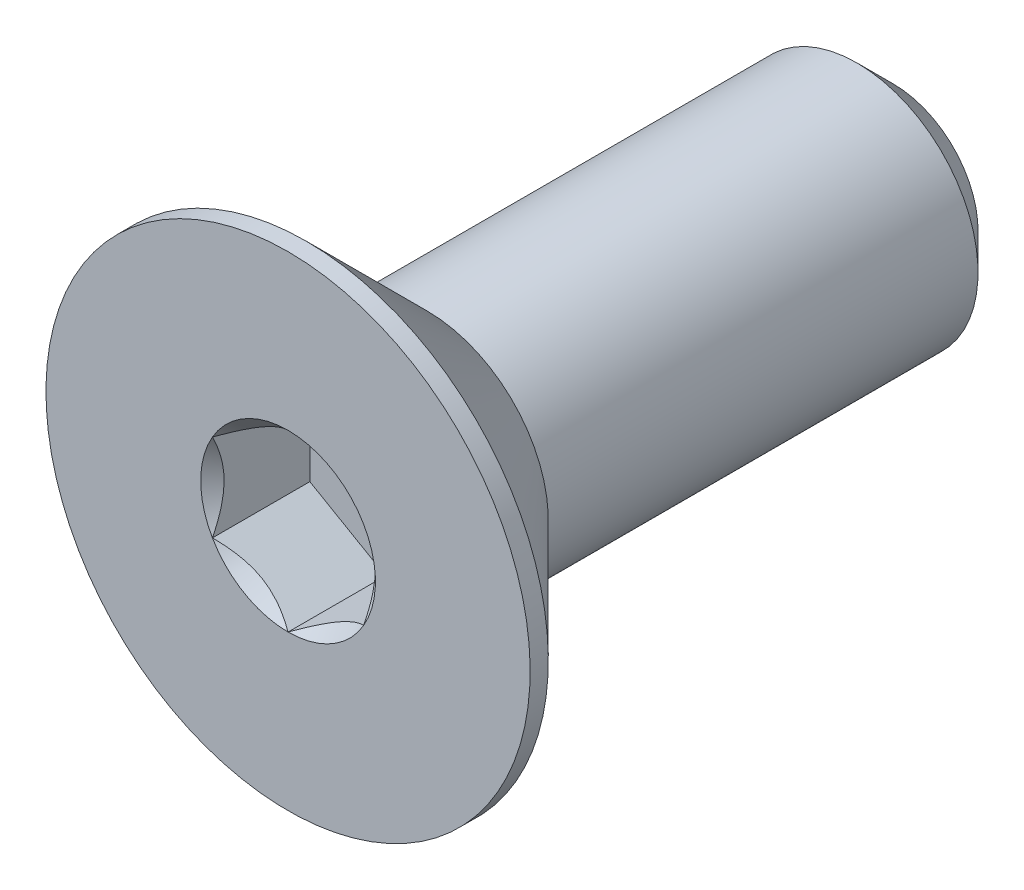
ISO-10303-21;
HEADER;
FILE_DESCRIPTION(('STEP AP214'),'2;1');
FILE_NAME('part.step','',(''),(''),'','','');
FILE_SCHEMA(('AUTOMOTIVE_DESIGN { 1 0 10303 214 1 1 1 1 }'));
ENDSEC;
DATA;
#1=APPLICATION_CONTEXT('core data for automotive mechanical design processes');
#2=APPLICATION_PROTOCOL_DEFINITION('international standard','automotive_design',2000,#1);
#3=PRODUCT_CONTEXT('',#1,'mechanical');
#4=PRODUCT('Part','Part','',(#3));
#5=PRODUCT_RELATED_PRODUCT_CATEGORY('part','',(#4));
#6=PRODUCT_DEFINITION_FORMATION('','',#4);
#7=PRODUCT_DEFINITION_CONTEXT('part definition',#1,'design');
#8=PRODUCT_DEFINITION('design','',#6,#7);
#9=PRODUCT_DEFINITION_SHAPE('','',#8);
#10=(LENGTH_UNIT() NAMED_UNIT(*) SI_UNIT(.MILLI.,.METRE.));
#11=(NAMED_UNIT(*) PLANE_ANGLE_UNIT() SI_UNIT($,.RADIAN.));
#12=(NAMED_UNIT(*) SI_UNIT($,.STERADIAN.) SOLID_ANGLE_UNIT());
#13=UNCERTAINTY_MEASURE_WITH_UNIT(LENGTH_MEASURE(1.E-05),#10,'distance_accuracy_value','');
#14=(GEOMETRIC_REPRESENTATION_CONTEXT(3) GLOBAL_UNCERTAINTY_ASSIGNED_CONTEXT((#13)) GLOBAL_UNIT_ASSIGNED_CONTEXT((#10,
#11,#12)) REPRESENTATION_CONTEXT('',''));
#15=CARTESIAN_POINT('',(0.,0.,0.));
#16=DIRECTION('',(0.,0.,1.));
#17=DIRECTION('',(1.,0.,0.));
#18=AXIS2_PLACEMENT_3D('',#15,#16,#17);
#19=CARTESIAN_POINT('',(0.,0.,-5.));
#20=DIRECTION('',(0.,0.,-1.));
#21=DIRECTION('',(0.,1.,0.));
#22=AXIS2_PLACEMENT_3D('',#19,#20,#21);
#23=CYLINDRICAL_SURFACE('',#22,2.);
#24=CARTESIAN_POINT('',(0.,0.,2.7));
#25=DIRECTION('',(0.,0.,-1.));
#26=DIRECTION('',(0.,1.,0.));
#27=AXIS2_PLACEMENT_3D('',#24,#25,#26);
#28=CIRCLE('',#27,2.);
#29=CARTESIAN_POINT('',(0.,2.,2.7));
#30=VERTEX_POINT('',#29);
#31=EDGE_CURVE('E11',#30,#30,#28,.F.);
#32=ORIENTED_EDGE('',*,*,#31,.F.);
#33=EDGE_LOOP('',(#32));
#34=FACE_BOUND('',#33,.T.);
#35=CARTESIAN_POINT('',(0.,0.,-4.39999999999999));
#36=DIRECTION('',(0.,0.,-1.));
#37=DIRECTION('',(0.,1.,0.));
#38=AXIS2_PLACEMENT_3D('',#35,#36,#37);
#39=CIRCLE('',#38,2.);
#40=CARTESIAN_POINT('',(0.,2.,-4.39999999999999));
#41=VERTEX_POINT('',#40);
#42=EDGE_CURVE('E47',#41,#41,#39,.F.);
#43=ORIENTED_EDGE('',*,*,#42,.T.);
#44=EDGE_LOOP('',(#43));
#45=FACE_BOUND('',#44,.T.);
#46=ADVANCED_FACE('F39',(#34,#45),#23,.T.);
#47=CARTESIAN_POINT('',(0.,2.,-5.));
#48=DIRECTION('',(0.,0.,-1.));
#49=DIRECTION('',(0.,1.,0.));
#50=AXIS2_PLACEMENT_3D('',#47,#48,#49);
#51=PLANE('',#50);
#52=CARTESIAN_POINT('',(0.,0.,-5.));
#53=DIRECTION('',(0.,0.,-1.));
#54=DIRECTION('',(0.,1.,0.));
#55=AXIS2_PLACEMENT_3D('',#52,#53,#54);
#56=CIRCLE('',#55,1.39999999999999);
#57=CARTESIAN_POINT('',(0.,1.39999999999999,-5.));
#58=VERTEX_POINT('',#57);
#59=EDGE_CURVE('E151',#58,#58,#56,.T.);
#60=ORIENTED_EDGE('',*,*,#59,.T.);
#61=EDGE_LOOP('',(#60));
#62=FACE_BOUND('',#61,.T.);
#63=ADVANCED_FACE('F160',(#62),#51,.T.);
#64=CARTESIAN_POINT('',(0.,0.,-5.));
#65=DIRECTION('',(0.,0.,1.));
#66=DIRECTION('',(0.,-1.,0.));
#67=AXIS2_PLACEMENT_3D('',#64,#65,#66);
#68=CONICAL_SURFACE('',#67,1.39999999999999,0.785398163397446);
#69=ORIENTED_EDGE('',*,*,#42,.F.);
#70=EDGE_LOOP('',(#69));
#71=FACE_BOUND('',#70,.T.);
#72=ORIENTED_EDGE('',*,*,#59,.F.);
#73=EDGE_LOOP('',(#72));
#74=FACE_BOUND('',#73,.T.);
#75=ADVANCED_FACE('F41',(#71,#74),#68,.T.);
#76=CARTESIAN_POINT('',(0.,0.,-5.));
#77=DIRECTION('',(0.,0.,-1.));
#78=DIRECTION('',(0.,1.,0.));
#79=AXIS2_PLACEMENT_3D('',#76,#77,#78);
#80=CYLINDRICAL_SURFACE('',#79,4.);
#81=CARTESIAN_POINT('',(0.,0.,5.));
#82=DIRECTION('',(0.,0.,-1.));
#83=DIRECTION('',(0.,1.,0.));
#84=AXIS2_PLACEMENT_3D('',#81,#82,#83);
#85=CIRCLE('',#84,4.);
#86=CARTESIAN_POINT('',(0.,4.,5.));
#87=VERTEX_POINT('',#86);
#88=EDGE_CURVE('E131',#87,#87,#85,.T.);
#89=ORIENTED_EDGE('',*,*,#88,.T.);
#90=EDGE_LOOP('',(#89));
#91=FACE_BOUND('',#90,.T.);
#92=CARTESIAN_POINT('',(0.,0.,4.7));
#93=DIRECTION('',(0.,0.,-1.));
#94=DIRECTION('',(0.,1.,0.));
#95=AXIS2_PLACEMENT_3D('',#92,#93,#94);
#96=CIRCLE('',#95,4.);
#97=CARTESIAN_POINT('',(0.,4.,4.7));
#98=VERTEX_POINT('',#97);
#99=EDGE_CURVE('E128',#98,#98,#96,.T.);
#100=ORIENTED_EDGE('',*,*,#99,.F.);
#101=EDGE_LOOP('',(#100));
#102=FACE_BOUND('',#101,.T.);
#103=ADVANCED_FACE('F159',(#91,#102),#80,.T.);
#104=CARTESIAN_POINT('',(0.,0.,2.7));
#105=DIRECTION('',(0.,0.,1.));
#106=DIRECTION('',(0.,-1.,0.));
#107=AXIS2_PLACEMENT_3D('',#104,#105,#106);
#108=CONICAL_SURFACE('',#107,2.,0.78539816339745);
#109=ORIENTED_EDGE('',*,*,#99,.T.);
#110=EDGE_LOOP('',(#109));
#111=FACE_BOUND('',#110,.T.);
#112=ORIENTED_EDGE('',*,*,#31,.T.);
#113=EDGE_LOOP('',(#112));
#114=FACE_BOUND('',#113,.T.);
#115=ADVANCED_FACE('F173',(#111,#114),#108,.T.);
#116=CARTESIAN_POINT('',(0.,0.,5.));
#117=DIRECTION('',(0.,0.,1.));
#118=DIRECTION('',(0.,-1.,0.));
#119=AXIS2_PLACEMENT_3D('',#116,#117,#118);
#120=PLANE('',#119);
#121=CARTESIAN_POINT('',(0.,0.,5.));
#122=DIRECTION('',(0.,0.,1.));
#123=DIRECTION('',(1.,0.,0.));
#124=AXIS2_PLACEMENT_3D('',#121,#122,#123);
#125=CIRCLE('',#124,1.44337567297406);
#126=CARTESIAN_POINT('',(1.25,0.721687836487038,5.));
#127=VERTEX_POINT('',#126);
#128=CARTESIAN_POINT('',(0.,1.44337567297407,5.));
#129=VERTEX_POINT('',#128);
#130=EDGE_CURVE('E98',#127,#129,#125,.T.);
#131=ORIENTED_EDGE('',*,*,#130,.F.);
#132=CARTESIAN_POINT('',(0.,0.,5.));
#133=DIRECTION('',(0.,0.,1.));
#134=DIRECTION('',(1.,0.,0.));
#135=AXIS2_PLACEMENT_3D('',#132,#133,#134);
#136=CIRCLE('',#135,1.44337567297406);
#137=CARTESIAN_POINT('',(1.24999999999999,-0.721687836487039,5.));
#138=VERTEX_POINT('',#137);
#139=EDGE_CURVE('E110',#138,#127,#136,.T.);
#140=ORIENTED_EDGE('',*,*,#139,.F.);
#141=CARTESIAN_POINT('',(0.,0.,5.));
#142=DIRECTION('',(0.,0.,1.));
#143=DIRECTION('',(1.,0.,0.));
#144=AXIS2_PLACEMENT_3D('',#141,#142,#143);
#145=CIRCLE('',#144,1.44337567297406);
#146=CARTESIAN_POINT('',(0.,-1.44337567297405,5.));
#147=VERTEX_POINT('',#146);
#148=EDGE_CURVE('E244',#147,#138,#145,.T.);
#149=ORIENTED_EDGE('',*,*,#148,.F.);
#150=CARTESIAN_POINT('',(0.,0.,5.));
#151=DIRECTION('',(0.,0.,1.));
#152=DIRECTION('',(1.,0.,0.));
#153=AXIS2_PLACEMENT_3D('',#150,#151,#152);
#154=CIRCLE('',#153,1.44337567297406);
#155=CARTESIAN_POINT('',(-1.25,-0.72168783648702,5.));
#156=VERTEX_POINT('',#155);
#157=EDGE_CURVE('E123',#156,#147,#154,.T.);
#158=ORIENTED_EDGE('',*,*,#157,.F.);
#159=CARTESIAN_POINT('',(0.,0.,5.));
#160=DIRECTION('',(0.,0.,1.));
#161=DIRECTION('',(1.,0.,0.));
#162=AXIS2_PLACEMENT_3D('',#159,#160,#161);
#163=CIRCLE('',#162,1.44337567297406);
#164=CARTESIAN_POINT('',(-1.25,0.72168783648703,5.));
#165=VERTEX_POINT('',#164);
#166=EDGE_CURVE('E245',#165,#156,#163,.T.);
#167=ORIENTED_EDGE('',*,*,#166,.F.);
#168=CARTESIAN_POINT('',(0.,0.,5.));
#169=DIRECTION('',(0.,0.,1.));
#170=DIRECTION('',(1.,0.,0.));
#171=AXIS2_PLACEMENT_3D('',#168,#169,#170);
#172=CIRCLE('',#171,1.44337567297406);
#173=EDGE_CURVE('E113',#129,#165,#172,.T.);
#174=ORIENTED_EDGE('',*,*,#173,.F.);
#175=EDGE_LOOP('',(#131,#140,#149,#158,#167,#174));
#176=FACE_BOUND('',#175,.T.);
#177=ORIENTED_EDGE('',*,*,#88,.F.);
#178=EDGE_LOOP('',(#177));
#179=FACE_BOUND('',#178,.T.);
#180=ADVANCED_FACE('F107',(#176,#179),#120,.T.);
#181=CARTESIAN_POINT('',(1.25,0.721687836487033,3.39));
#182=DIRECTION('',(0.5,0.866025403784439,0.));
#183=DIRECTION('',(-0.866025403784439,0.5,0.));
#184=AXIS2_PLACEMENT_3D('',#181,#182,#183);
#185=PLANE('',#184);
#186=DIRECTION('',(0.,0.,1.));
#187=VECTOR('',#186,1.);
#188=CARTESIAN_POINT('',(1.25,0.721687836487033,3.39));
#189=LINE('',#188,#187);
#190=CARTESIAN_POINT('',(1.25,0.721687836487033,3.39));
#191=VERTEX_POINT('',#190);
#192=EDGE_CURVE('E54',#191,#127,#189,.T.);
#193=ORIENTED_EDGE('',*,*,#192,.T.);
#194=CARTESIAN_POINT('',(-0.000199999999999501,1.4434911430279,5.00011548390913));
#195=CARTESIAN_POINT('',(0.0427751670715868,1.41867941875065,4.9753216680551));
#196=CARTESIAN_POINT('',(0.0864690047459479,1.39345276980743,4.95198373441868));
#197=CARTESIAN_POINT('',(0.175565930841941,1.34201263554194,4.90925200408453));
#198=CARTESIAN_POINT('',(0.220977498357063,1.31579425481276,4.88988199236041));
#199=CARTESIAN_POINT('',(0.312547820935258,1.26292610442246,4.85670048341347));
#200=CARTESIAN_POINT('',(0.358683240175884,1.23628980770471,4.84280555905265));
#201=CARTESIAN_POINT('',(0.45197008040759,1.18243062538509,4.82139728216063));
#202=CARTESIAN_POINT('',(0.499118649136377,1.15520938653762,4.81386794156678));
#203=CARTESIAN_POINT('',(0.580373556887249,1.10829684367467,4.8070744980507));
#204=CARTESIAN_POINT('',(0.614374876627937,1.08866617256958,4.80606855910435));
#205=CARTESIAN_POINT('',(0.682317764432473,1.04943932800611,4.80776141491131));
#206=CARTESIAN_POINT('',(0.716259317655653,1.029843163116,4.81046102721553));
#207=CARTESIAN_POINT('',(0.783814856457495,0.990839954603503,4.81940893031637));
#208=CARTESIAN_POINT('',(0.81742850728677,0.971433104248775,4.8256605258997));
#209=CARTESIAN_POINT('',(0.884094638217808,0.932943395609909,4.8413756814139));
#210=CARTESIAN_POINT('',(0.91714687103029,0.913860680098304,4.85084062008745));
#211=CARTESIAN_POINT('',(1.00179969160026,0.864986351354571,4.87893139068758));
#212=CARTESIAN_POINT('',(1.05286649242963,0.835502920149078,4.8996701574522));
#213=CARTESIAN_POINT('',(1.15300085411325,0.77769031947591,4.94638713467147));
#214=CARTESIAN_POINT('',(1.20207431157827,0.749357745598418,4.97234829594676));
#215=CARTESIAN_POINT('',(1.2502,0.721572366433195,5.00011548390913));
#216=B_SPLINE_CURVE_WITH_KNOTS('',3,(#194,#195,#196,#197,#198,#199,#200,#201,#202,#203,#204,
#205,#206,#207,#208,#209,#210,#211,#212,#213,#214,#215),.UNSPECIFIED.,.F.,.F.,(4,2,2,2,2,2,2,2,
2,2,4),(0.,0.166533409618302,0.334037607289759,0.498880396489695,0.66330791924027,
0.780963963458821,0.898645970148446,1.01643764860773,1.13427993171549,1.3214865203214,
1.50809158792573),.UNSPECIFIED.);
#217=EDGE_CURVE('E95',#129,#127,#216,.T.);
#218=ORIENTED_EDGE('',*,*,#217,.F.);
#219=DIRECTION('',(0.,0.,1.));
#220=VECTOR('',#219,1.);
#221=CARTESIAN_POINT('',(0.,1.44337567297406,3.39));
#222=LINE('',#221,#220);
#223=CARTESIAN_POINT('',(0.,1.44337567297406,3.39));
#224=VERTEX_POINT('',#223);
#225=EDGE_CURVE('E147',#224,#129,#222,.T.);
#226=ORIENTED_EDGE('',*,*,#225,.F.);
#227=DIRECTION('',(-0.866025403784439,0.5,0.));
#228=VECTOR('',#227,1.);
#229=CARTESIAN_POINT('',(1.25,0.721687836487033,3.39));
#230=LINE('',#229,#228);
#231=EDGE_CURVE('E120',#191,#224,#230,.T.);
#232=ORIENTED_EDGE('',*,*,#231,.F.);
#233=EDGE_LOOP('',(#193,#218,#226,#232));
#234=FACE_BOUND('',#233,.T.);
#235=ADVANCED_FACE('F125',(#234),#185,.F.);
#236=CARTESIAN_POINT('',(1.25,-0.721687836487033,3.39));
#237=DIRECTION('',(1.,0.,0.));
#238=DIRECTION('',(0.,1.,0.));
#239=AXIS2_PLACEMENT_3D('',#236,#237,#238);
#240=PLANE('',#239);
#241=DIRECTION('',(0.,0.,1.));
#242=VECTOR('',#241,1.);
#243=CARTESIAN_POINT('',(1.25,-0.721687836487033,3.39));
#244=LINE('',#243,#242);
#245=CARTESIAN_POINT('',(1.25,-0.721687836487033,3.39));
#246=VERTEX_POINT('',#245);
#247=EDGE_CURVE('E62',#246,#138,#244,.T.);
#248=ORIENTED_EDGE('',*,*,#247,.T.);
#249=CARTESIAN_POINT('',(1.25,-1.43934010808078,5.46298209689234));
#250=CARTESIAN_POINT('',(1.25,-1.40429313005659,5.4365249226329));
#251=CARTESIAN_POINT('',(1.25,-1.369050871356,5.41032716035429));
#252=CARTESIAN_POINT('',(1.25,-1.29809650706311,5.3585575718396));
#253=CARTESIAN_POINT('',(1.25,-1.26238428576496,5.33298590435631));
#254=CARTESIAN_POINT('',(1.25,-1.15390111792708,5.25700599368947));
#255=CARTESIAN_POINT('',(1.25,-1.08031646726265,5.20774028618958));
#256=CARTESIAN_POINT('',(1.25,-0.926012322755098,5.11102583026314));
#257=CARTESIAN_POINT('',(1.25,-0.845125318656149,5.0638412989418));
#258=CARTESIAN_POINT('',(1.25,-0.679311174076603,4.97753073439042));
#259=CARTESIAN_POINT('',(1.25,-0.594398891026687,4.93837753462691));
#260=CARTESIAN_POINT('',(1.25,-0.466944812460739,4.8904772236883));
#261=CARTESIAN_POINT('',(1.25,-0.42628998581282,4.87672948978634));
#262=CARTESIAN_POINT('',(1.25,-0.343998850091265,4.85249792745055));
#263=CARTESIAN_POINT('',(1.25,-0.30236247361496,4.84201432386978));
#264=CARTESIAN_POINT('',(1.25,-0.219052696285662,4.8250301617483));
#265=CARTESIAN_POINT('',(1.25,-0.177393428474497,4.81846136047137));
#266=CARTESIAN_POINT('',(1.25,-0.0936293693401884,4.80943505345776));
#267=CARTESIAN_POINT('',(1.25,-0.051524655854392,4.80697684099727));
#268=CARTESIAN_POINT('',(1.25,0.0311890576306361,4.80635406201329));
#269=CARTESIAN_POINT('',(1.25,0.0717969625499351,4.80803711684625));
#270=CARTESIAN_POINT('',(1.25,0.152668636885202,4.81526827059791));
#271=CARTESIAN_POINT('',(1.25,0.192932338835363,4.82081711041311));
#272=CARTESIAN_POINT('',(1.25,0.273499879165301,4.83557103646495));
#273=CARTESIAN_POINT('',(1.25,0.313792180618517,4.84483817596411));
#274=CARTESIAN_POINT('',(1.25,0.393496413911464,4.86653617845735));
#275=CARTESIAN_POINT('',(1.25,0.432908419115065,4.87896677673065));
#276=CARTESIAN_POINT('',(1.25,0.556992735862305,4.92277935293144));
#277=CARTESIAN_POINT('',(1.25,0.639898924666092,4.95915107287596));
#278=CARTESIAN_POINT('',(1.25,0.801816555499707,5.04001916217834));
#279=CARTESIAN_POINT('',(1.25,0.88081266632505,5.08454472091199));
#280=CARTESIAN_POINT('',(1.25,1.0317856127975,5.17640487666662));
#281=CARTESIAN_POINT('',(1.25,1.10391618485086,5.22348993391625));
#282=CARTESIAN_POINT('',(1.25,1.21018606043311,5.29627856159854));
#283=CARTESIAN_POINT('',(1.25,1.2451506996938,5.32079808539336));
#284=CARTESIAN_POINT('',(1.25,1.31460220852737,5.37048563676568));
#285=CARTESIAN_POINT('',(1.25,1.34908920596618,5.39565348541552));
#286=CARTESIAN_POINT('',(1.25,1.38337731682912,5.42109014884121));
#287=B_SPLINE_CURVE_WITH_KNOTS('',3,(#249,#250,#251,#252,#253,#254,#255,#256,#257,#258,#259,
#260,#261,#262,#263,#264,#265,#266,#267,#268,#269,#270,#271,#272,#273,#274,#275,#276,#277,#278,
#279,#280,#281,#282,#283,#284,#285,#286),.UNSPECIFIED.,.F.,.F.,(4,2,2,2,2,2,2,2,2,2,2,2,2,2,2,2,
2,2,4),(0.,0.13173296038145,0.263498984161648,0.529042014455831,0.809741926134627,
1.08947609717226,1.21811634272578,1.34676544783902,1.47310084517845,1.59941451973786,
1.72115042167851,1.84290966131737,1.96679153905343,2.09066305366041,2.36146692896011,
2.63325989198493,2.89154668212281,3.01965734507714,3.1477330224563),.UNSPECIFIED.);
#288=EDGE_CURVE('E119',#127,#138,#287,.F.);
#289=ORIENTED_EDGE('',*,*,#288,.F.);
#290=ORIENTED_EDGE('',*,*,#192,.F.);
#291=DIRECTION('',(0.,1.,0.));
#292=VECTOR('',#291,1.);
#293=CARTESIAN_POINT('',(1.25,-0.721687836487033,3.39));
#294=LINE('',#293,#292);
#295=EDGE_CURVE('E136',#246,#191,#294,.T.);
#296=ORIENTED_EDGE('',*,*,#295,.F.);
#297=EDGE_LOOP('',(#248,#289,#290,#296));
#298=FACE_BOUND('',#297,.T.);
#299=ADVANCED_FACE('F122',(#298),#240,.F.);
#300=CARTESIAN_POINT('',(0.,-1.44337567297406,3.39));
#301=DIRECTION('',(0.5,-0.866025403784439,0.));
#302=DIRECTION('',(0.866025403784439,0.5,0.));
#303=AXIS2_PLACEMENT_3D('',#300,#301,#302);
#304=PLANE('',#303);
#305=DIRECTION('',(0.,0.,1.));
#306=VECTOR('',#305,1.);
#307=CARTESIAN_POINT('',(0.,-1.44337567297406,3.39));
#308=LINE('',#307,#306);
#309=CARTESIAN_POINT('',(0.,-1.44337567297406,3.39));
#310=VERTEX_POINT('',#309);
#311=EDGE_CURVE('E133',#310,#147,#308,.T.);
#312=ORIENTED_EDGE('',*,*,#311,.T.);
#313=CARTESIAN_POINT('',(1.2502,-0.721572366433196,5.00011548390914));
#314=CARTESIAN_POINT('',(1.20722483292841,-0.746384090710445,4.97532166805511));
#315=CARTESIAN_POINT('',(1.16353099525405,-0.771610739653665,4.95198373441869));
#316=CARTESIAN_POINT('',(1.07443406915806,-0.823050873919155,4.90925200408454));
#317=CARTESIAN_POINT('',(1.02902250164294,-0.849269254648334,4.88988199236042));
#318=CARTESIAN_POINT('',(0.937452179064742,-0.902137405038635,4.85670048341349));
#319=CARTESIAN_POINT('',(0.891316759824116,-0.928773701756387,4.84280555905266));
#320=CARTESIAN_POINT('',(0.79802991959241,-0.982632884076012,4.82139728216065));
#321=CARTESIAN_POINT('',(0.750881350863623,-1.00985412292348,4.8138679415668));
#322=CARTESIAN_POINT('',(0.669626443112751,-1.05676666578643,4.80707449805071));
#323=CARTESIAN_POINT('',(0.635625123372062,-1.07639733689152,4.80606855910436));
#324=CARTESIAN_POINT('',(0.567682235567525,-1.11562418145499,4.80776141491133));
#325=CARTESIAN_POINT('',(0.533740682344345,-1.1352203463451,4.81046102721555));
#326=CARTESIAN_POINT('',(0.466185143542503,-1.1742235548576,4.81940893031639));
#327=CARTESIAN_POINT('',(0.432571492713227,-1.19363040521233,4.82566052589972));
#328=CARTESIAN_POINT('',(0.365905361782188,-1.23212011385119,4.84137568141391));
#329=CARTESIAN_POINT('',(0.332853128969706,-1.2512028293628,4.85084062008747));
#330=CARTESIAN_POINT('',(0.248200308399737,-1.30007715810653,4.8789313906876));
#331=CARTESIAN_POINT('',(0.197133507570363,-1.32956058931202,4.89967015745221));
#332=CARTESIAN_POINT('',(0.0969991458867455,-1.38737318998519,4.94638713467149));
#333=CARTESIAN_POINT('',(0.0479256884217307,-1.41570576386268,4.97234829594678));
#334=CARTESIAN_POINT('',(-0.000200000000000106,-1.4434911430279,5.00011548390915));
#335=B_SPLINE_CURVE_WITH_KNOTS('',3,(#313,#314,#315,#316,#317,#318,#319,#320,#321,#322,#323,
#324,#325,#326,#327,#328,#329,#330,#331,#332,#333,#334),.UNSPECIFIED.,.F.,.F.,(4,2,2,2,2,2,2,2,
2,2,4),(0.,0.166533409618302,0.334037607289759,0.498880396489694,0.663307919240269,
0.780963963458821,0.898645970148448,1.01643764860773,1.13427993171549,1.32148652032141,
1.50809158792573),.UNSPECIFIED.);
#336=EDGE_CURVE('E242',#138,#147,#335,.T.);
#337=ORIENTED_EDGE('',*,*,#336,.F.);
#338=ORIENTED_EDGE('',*,*,#247,.F.);
#339=DIRECTION('',(0.866025403784439,0.5,0.));
#340=VECTOR('',#339,1.);
#341=CARTESIAN_POINT('',(0.,-1.44337567297406,3.39));
#342=LINE('',#341,#340);
#343=EDGE_CURVE('E234',#310,#246,#342,.T.);
#344=ORIENTED_EDGE('',*,*,#343,.F.);
#345=EDGE_LOOP('',(#312,#337,#338,#344));
#346=FACE_BOUND('',#345,.T.);
#347=ADVANCED_FACE('F199',(#346),#304,.F.);
#348=CARTESIAN_POINT('',(-1.25,-0.721687836487032,3.39));
#349=DIRECTION('',(-0.5,-0.866025403784438,0.));
#350=DIRECTION('',(0.866025403784439,-0.5,0.));
#351=AXIS2_PLACEMENT_3D('',#348,#349,#350);
#352=PLANE('',#351);
#353=DIRECTION('',(0.,0.,1.));
#354=VECTOR('',#353,1.);
#355=CARTESIAN_POINT('',(-1.25,-0.721687836487032,3.39));
#356=LINE('',#355,#354);
#357=CARTESIAN_POINT('',(-1.25,-0.721687836487032,3.39));
#358=VERTEX_POINT('',#357);
#359=EDGE_CURVE('E141',#358,#156,#356,.T.);
#360=ORIENTED_EDGE('',*,*,#359,.T.);
#361=CARTESIAN_POINT('',(0.000200000000000028,-1.4434911430279,5.00011548390915));
#362=CARTESIAN_POINT('',(-0.0427751670715866,-1.41867941875065,4.97532166805512));
#363=CARTESIAN_POINT('',(-0.0864690047459481,-1.39345276980743,4.95198373441869));
#364=CARTESIAN_POINT('',(-0.175565930841942,-1.34201263554194,4.90925200408455));
#365=CARTESIAN_POINT('',(-0.220977498357065,-1.31579425481276,4.88988199236042));
#366=CARTESIAN_POINT('',(-0.312547820935261,-1.26292610442246,4.85670048341349));
#367=CARTESIAN_POINT('',(-0.358683240175887,-1.23628980770471,4.84280555905267));
#368=CARTESIAN_POINT('',(-0.451970080407595,-1.18243062538508,4.82139728216065));
#369=CARTESIAN_POINT('',(-0.499118649136382,-1.15520938653761,4.8138679415668));
#370=CARTESIAN_POINT('',(-0.580373556887255,-1.10829684367467,4.80707449805071));
#371=CARTESIAN_POINT('',(-0.614374876627944,-1.08866617256958,4.80606855910436));
#372=CARTESIAN_POINT('',(-0.682317764432481,-1.04943932800611,4.80776141491133));
#373=CARTESIAN_POINT('',(-0.716259317655661,-1.02984316311599,4.81046102721555));
#374=CARTESIAN_POINT('',(-0.783814856457504,-0.990839954603497,4.81940893031639));
#375=CARTESIAN_POINT('',(-0.817428507286779,-0.971433104248769,4.82566052589972));
#376=CARTESIAN_POINT('',(-0.884094638217818,-0.932943395609903,4.84137568141391));
#377=CARTESIAN_POINT('',(-0.917146871030301,-0.913860680098298,4.85084062008747));
#378=CARTESIAN_POINT('',(-1.00179969160027,-0.864986351354566,4.8789313906876));
#379=CARTESIAN_POINT('',(-1.05286649242964,-0.835502920149074,4.89967015745221));
#380=CARTESIAN_POINT('',(-1.15300085411326,-0.777690319475908,4.94638713467148));
#381=CARTESIAN_POINT('',(-1.20207431157827,-0.749357745598416,4.97234829594677));
#382=CARTESIAN_POINT('',(-1.2502,-0.721572366433195,5.00011548390914));
#383=B_SPLINE_CURVE_WITH_KNOTS('',3,(#361,#362,#363,#364,#365,#366,#367,#368,#369,#370,#371,
#372,#373,#374,#375,#376,#377,#378,#379,#380,#381,#382),.UNSPECIFIED.,.F.,.F.,(4,2,2,2,2,2,2,2,
2,2,4),(0.,0.166533409618304,0.334037607289763,0.498880396489701,0.663307919240278,
0.780963963458831,0.898645970148458,1.01643764860774,1.1342799317155,1.32148652032141,
1.50809158792573),.UNSPECIFIED.);
#384=EDGE_CURVE('E216',#147,#156,#383,.T.);
#385=ORIENTED_EDGE('',*,*,#384,.F.);
#386=ORIENTED_EDGE('',*,*,#311,.F.);
#387=DIRECTION('',(0.866025403784438,-0.5,0.));
#388=VECTOR('',#387,1.);
#389=CARTESIAN_POINT('',(-1.25,-0.721687836487032,3.39));
#390=LINE('',#389,#388);
#391=EDGE_CURVE('E232',#358,#310,#390,.T.);
#392=ORIENTED_EDGE('',*,*,#391,.F.);
#393=EDGE_LOOP('',(#360,#385,#386,#392));
#394=FACE_BOUND('',#393,.T.);
#395=ADVANCED_FACE('F195',(#394),#352,.F.);
#396=CARTESIAN_POINT('',(-1.25,0.721687836487033,3.39));
#397=DIRECTION('',(-1.,0.,0.));
#398=DIRECTION('',(0.,0.,1.));
#399=AXIS2_PLACEMENT_3D('',#396,#397,#398);
#400=PLANE('',#399);
#401=DIRECTION('',(0.,0.,1.));
#402=VECTOR('',#401,1.);
#403=CARTESIAN_POINT('',(-1.25,0.721687836487033,3.39));
#404=LINE('',#403,#402);
#405=CARTESIAN_POINT('',(-1.25,0.721687836487033,3.39));
#406=VERTEX_POINT('',#405);
#407=EDGE_CURVE('E144',#406,#165,#404,.T.);
#408=ORIENTED_EDGE('',*,*,#407,.T.);
#409=CARTESIAN_POINT('',(-1.25,-1.43934010808078,5.46298209689234));
#410=CARTESIAN_POINT('',(-1.25,-1.40429313005659,5.4365249226329));
#411=CARTESIAN_POINT('',(-1.25,-1.369050871356,5.41032716035429));
#412=CARTESIAN_POINT('',(-1.25,-1.29809650706311,5.3585575718396));
#413=CARTESIAN_POINT('',(-1.25,-1.26238428576496,5.33298590435631));
#414=CARTESIAN_POINT('',(-1.25,-1.15390111792708,5.25700599368948));
#415=CARTESIAN_POINT('',(-1.25,-1.08031646726265,5.20774028618958));
#416=CARTESIAN_POINT('',(-1.25,-0.926012322755097,5.11102583026314));
#417=CARTESIAN_POINT('',(-1.25,-0.845125318656147,5.0638412989418));
#418=CARTESIAN_POINT('',(-1.25,-0.679311174076601,4.97753073439042));
#419=CARTESIAN_POINT('',(-1.25,-0.594398891026686,4.93837753462691));
#420=CARTESIAN_POINT('',(-1.25,-0.466944812460738,4.8904772236883));
#421=CARTESIAN_POINT('',(-1.25,-0.426289985812819,4.87672948978634));
#422=CARTESIAN_POINT('',(-1.25,-0.343998850091264,4.85249792745055));
#423=CARTESIAN_POINT('',(-1.25,-0.302362473614959,4.84201432386978));
#424=CARTESIAN_POINT('',(-1.25,-0.219052696285661,4.8250301617483));
#425=CARTESIAN_POINT('',(-1.25,-0.177393428474495,4.81846136047137));
#426=CARTESIAN_POINT('',(-1.25,-0.093629369340187,4.80943505345776));
#427=CARTESIAN_POINT('',(-1.25,-0.0515246558543907,4.80697684099727));
#428=CARTESIAN_POINT('',(-1.25,0.0311890576306373,4.80635406201329));
#429=CARTESIAN_POINT('',(-1.25,0.0717969625499363,4.80803711684625));
#430=CARTESIAN_POINT('',(-1.25,0.152668636885203,4.81526827059792));
#431=CARTESIAN_POINT('',(-1.25,0.192932338835364,4.82081711041311));
#432=CARTESIAN_POINT('',(-1.25,0.273499879165302,4.83557103646496));
#433=CARTESIAN_POINT('',(-1.25,0.313792180618518,4.84483817596411));
#434=CARTESIAN_POINT('',(-1.25,0.393496413911465,4.86653617845735));
#435=CARTESIAN_POINT('',(-1.25,0.432908419115067,4.87896677673065));
#436=CARTESIAN_POINT('',(-1.25,0.556992735862306,4.92277935293144));
#437=CARTESIAN_POINT('',(-1.25,0.639898924666093,4.95915107287596));
#438=CARTESIAN_POINT('',(-1.25,0.801816555499709,5.04001916217834));
#439=CARTESIAN_POINT('',(-1.25,0.880812666325052,5.08454472091199));
#440=CARTESIAN_POINT('',(-1.25,1.03178561279751,5.17640487666663));
#441=CARTESIAN_POINT('',(-1.25,1.10391618485086,5.22348993391625));
#442=CARTESIAN_POINT('',(-1.25,1.21018606043311,5.29627856159854));
#443=CARTESIAN_POINT('',(-1.25,1.2451506996938,5.32079808539336));
#444=CARTESIAN_POINT('',(-1.25,1.31460220852737,5.37048563676568));
#445=CARTESIAN_POINT('',(-1.25,1.34908920596619,5.39565348541552));
#446=CARTESIAN_POINT('',(-1.25,1.38337731682912,5.42109014884121));
#447=B_SPLINE_CURVE_WITH_KNOTS('',3,(#409,#410,#411,#412,#413,#414,#415,#416,#417,#418,#419,
#420,#421,#422,#423,#424,#425,#426,#427,#428,#429,#430,#431,#432,#433,#434,#435,#436,#437,#438,
#439,#440,#441,#442,#443,#444,#445,#446),.UNSPECIFIED.,.F.,.F.,(4,2,2,2,2,2,2,2,2,2,2,2,2,2,2,2,
2,2,4),(0.,0.13173296038145,0.263498984161647,0.52904201445583,0.809741926134627,
1.08947609717226,1.21811634272578,1.34676544783902,1.47310084517845,1.59941451973786,
1.72115042167851,1.84290966131736,1.96679153905343,2.09066305366041,2.36146692896011,
2.63325989198493,2.89154668212281,3.01965734507714,3.1477330224563),.UNSPECIFIED.);
#448=EDGE_CURVE('E101',#156,#165,#447,.T.);
#449=ORIENTED_EDGE('',*,*,#448,.F.);
#450=ORIENTED_EDGE('',*,*,#359,.F.);
#451=DIRECTION('',(0.,-1.,0.));
#452=VECTOR('',#451,1.);
#453=CARTESIAN_POINT('',(-1.25,0.721687836487033,3.39));
#454=LINE('',#453,#452);
#455=EDGE_CURVE('E229',#406,#358,#454,.T.);
#456=ORIENTED_EDGE('',*,*,#455,.F.);
#457=EDGE_LOOP('',(#408,#449,#450,#456));
#458=FACE_BOUND('',#457,.T.);
#459=ADVANCED_FACE('F191',(#458),#400,.F.);
#460=CARTESIAN_POINT('',(0.,1.44337567297406,3.39));
#461=DIRECTION('',(-0.5,0.866025403784439,0.));
#462=DIRECTION('',(-0.866025403784439,-0.5,0.));
#463=AXIS2_PLACEMENT_3D('',#460,#461,#462);
#464=PLANE('',#463);
#465=ORIENTED_EDGE('',*,*,#225,.T.);
#466=CARTESIAN_POINT('',(-1.2502,0.721572366433195,5.00011548390913));
#467=CARTESIAN_POINT('',(-1.20722483292841,0.746384090710444,4.9753216680551));
#468=CARTESIAN_POINT('',(-1.16353099525405,0.771610739653665,4.95198373441868));
#469=CARTESIAN_POINT('',(-1.07443406915806,0.823050873919155,4.90925200408453));
#470=CARTESIAN_POINT('',(-1.02902250164294,0.849269254648334,4.88988199236041));
#471=CARTESIAN_POINT('',(-0.93745217906474,0.902137405038636,4.85670048341347));
#472=CARTESIAN_POINT('',(-0.891316759824114,0.928773701756388,4.84280555905265));
#473=CARTESIAN_POINT('',(-0.798029919592407,0.982632884076014,4.82139728216063));
#474=CARTESIAN_POINT('',(-0.750881350863619,1.00985412292348,4.81386794156678));
#475=CARTESIAN_POINT('',(-0.669626443112746,1.05676666578643,4.8070744980507));
#476=CARTESIAN_POINT('',(-0.635625123372058,1.07639733689152,4.80606855910435));
#477=CARTESIAN_POINT('',(-0.567682235567522,1.11562418145499,4.80776141491131));
#478=CARTESIAN_POINT('',(-0.533740682344342,1.1352203463451,4.81046102721553));
#479=CARTESIAN_POINT('',(-0.4661851435425,1.1742235548576,4.81940893031637));
#480=CARTESIAN_POINT('',(-0.432571492713225,1.19363040521233,4.8256605258997));
#481=CARTESIAN_POINT('',(-0.365905361782187,1.23212011385119,4.8413756814139));
#482=CARTESIAN_POINT('',(-0.332853128969705,1.2512028293628,4.85084062008745));
#483=CARTESIAN_POINT('',(-0.248200308399736,1.30007715810653,4.87893139068758));
#484=CARTESIAN_POINT('',(-0.197133507570362,1.32956058931202,4.89967015745219));
#485=CARTESIAN_POINT('',(-0.0969991458867453,1.38737318998519,4.94638713467147));
#486=CARTESIAN_POINT('',(-0.0479256884217305,1.41570576386268,4.97234829594676));
#487=CARTESIAN_POINT('',(0.000200000000000039,1.4434911430279,5.00011548390913));
#488=B_SPLINE_CURVE_WITH_KNOTS('',3,(#466,#467,#468,#469,#470,#471,#472,#473,#474,#475,#476,
#477,#478,#479,#480,#481,#482,#483,#484,#485,#486,#487),.UNSPECIFIED.,.F.,.F.,(4,2,2,2,2,2,2,2,
2,2,4),(0.,0.166533409618304,0.334037607289763,0.4988803964897,0.663307919240277,
0.780963963458829,0.898645970148454,1.01643764860773,1.1342799317155,1.32148652032141,
1.50809158792574),.UNSPECIFIED.);
#489=EDGE_CURVE('E238',#165,#129,#488,.T.);
#490=ORIENTED_EDGE('',*,*,#489,.F.);
#491=ORIENTED_EDGE('',*,*,#407,.F.);
#492=DIRECTION('',(-0.866025403784439,-0.5,0.));
#493=VECTOR('',#492,1.);
#494=CARTESIAN_POINT('',(0.,1.44337567297406,3.39));
#495=LINE('',#494,#493);
#496=EDGE_CURVE('E226',#224,#406,#495,.T.);
#497=ORIENTED_EDGE('',*,*,#496,.F.);
#498=EDGE_LOOP('',(#465,#490,#491,#497));
#499=FACE_BOUND('',#498,.T.);
#500=ADVANCED_FACE('F187',(#499),#464,.F.);
#501=CARTESIAN_POINT('',(0.,0.,3.39));
#502=DIRECTION('',(0.,0.,1.));
#503=DIRECTION('',(1.,0.,0.));
#504=AXIS2_PLACEMENT_3D('',#501,#502,#503);
#505=PLANE('',#504);
#506=ORIENTED_EDGE('',*,*,#231,.T.);
#507=ORIENTED_EDGE('',*,*,#496,.T.);
#508=ORIENTED_EDGE('',*,*,#455,.T.);
#509=ORIENTED_EDGE('',*,*,#391,.T.);
#510=ORIENTED_EDGE('',*,*,#343,.T.);
#511=ORIENTED_EDGE('',*,*,#295,.T.);
#512=EDGE_LOOP('',(#506,#507,#508,#509,#510,#511));
#513=FACE_BOUND('',#512,.T.);
#514=ADVANCED_FACE('F190',(#513),#505,.T.);
#515=CARTESIAN_POINT('',(0.,0.,5.));
#516=DIRECTION('',(0.,0.,1.));
#517=DIRECTION('',(1.,0.,0.));
#518=AXIS2_PLACEMENT_3D('',#515,#516,#517);
#519=CONICAL_SURFACE('',#518,1.44337567297406,0.78539816339745);
#520=ORIENTED_EDGE('',*,*,#489,.T.);
#521=ORIENTED_EDGE('',*,*,#173,.T.);
#522=EDGE_LOOP('',(#520,#521));
#523=FACE_BOUND('',#522,.T.);
#524=ADVANCED_FACE('F206',(#523),#519,.F.);
#525=CARTESIAN_POINT('',(0.,0.,5.));
#526=DIRECTION('',(0.,0.,1.));
#527=DIRECTION('',(1.,0.,0.));
#528=AXIS2_PLACEMENT_3D('',#525,#526,#527);
#529=CONICAL_SURFACE('',#528,1.44337567297406,0.78539816339745);
#530=ORIENTED_EDGE('',*,*,#384,.T.);
#531=ORIENTED_EDGE('',*,*,#157,.T.);
#532=EDGE_LOOP('',(#530,#531));
#533=FACE_BOUND('',#532,.T.);
#534=ADVANCED_FACE('F208',(#533),#529,.F.);
#535=CARTESIAN_POINT('',(0.,0.,5.));
#536=DIRECTION('',(0.,0.,1.));
#537=DIRECTION('',(1.,0.,0.));
#538=AXIS2_PLACEMENT_3D('',#535,#536,#537);
#539=CONICAL_SURFACE('',#538,1.44337567297406,0.78539816339745);
#540=ORIENTED_EDGE('',*,*,#288,.T.);
#541=ORIENTED_EDGE('',*,*,#139,.T.);
#542=EDGE_LOOP('',(#540,#541));
#543=FACE_BOUND('',#542,.T.);
#544=ADVANCED_FACE('F118',(#543),#539,.F.);
#545=CARTESIAN_POINT('',(0.,0.,5.));
#546=DIRECTION('',(0.,0.,1.));
#547=DIRECTION('',(1.,0.,0.));
#548=AXIS2_PLACEMENT_3D('',#545,#546,#547);
#549=CONICAL_SURFACE('',#548,1.44337567297406,0.78539816339745);
#550=ORIENTED_EDGE('',*,*,#336,.T.);
#551=ORIENTED_EDGE('',*,*,#148,.T.);
#552=EDGE_LOOP('',(#550,#551));
#553=FACE_BOUND('',#552,.T.);
#554=ADVANCED_FACE('F257',(#553),#549,.F.);
#555=CARTESIAN_POINT('',(0.,0.,5.));
#556=DIRECTION('',(0.,0.,1.));
#557=DIRECTION('',(1.,0.,0.));
#558=AXIS2_PLACEMENT_3D('',#555,#556,#557);
#559=CONICAL_SURFACE('',#558,1.44337567297406,0.78539816339745);
#560=ORIENTED_EDGE('',*,*,#448,.T.);
#561=ORIENTED_EDGE('',*,*,#166,.T.);
#562=EDGE_LOOP('',(#560,#561));
#563=FACE_BOUND('',#562,.T.);
#564=ADVANCED_FACE('F262',(#563),#559,.F.);
#565=CARTESIAN_POINT('',(0.,0.,5.));
#566=DIRECTION('',(0.,0.,1.));
#567=DIRECTION('',(1.,0.,0.));
#568=AXIS2_PLACEMENT_3D('',#565,#566,#567);
#569=CONICAL_SURFACE('',#568,1.44337567297406,0.78539816339745);
#570=ORIENTED_EDGE('',*,*,#217,.T.);
#571=ORIENTED_EDGE('',*,*,#130,.T.);
#572=EDGE_LOOP('',(#570,#571));
#573=FACE_BOUND('',#572,.T.);
#574=ADVANCED_FACE('F97',(#573),#569,.F.);
#575=CLOSED_SHELL('',(#46,#63,#75,#103,#115,#180,#235,#299,#347,#395,#459,#500,#514,#524,#534,
#544,#554,#564,#574));
#576=MANIFOLD_SOLID_BREP('B2',#575);
#577=ADVANCED_BREP_SHAPE_REPRESENTATION('',(#18,#576),#14);
#578=SHAPE_DEFINITION_REPRESENTATION(#9,#577);
ENDSEC;
END-ISO-10303-21;
